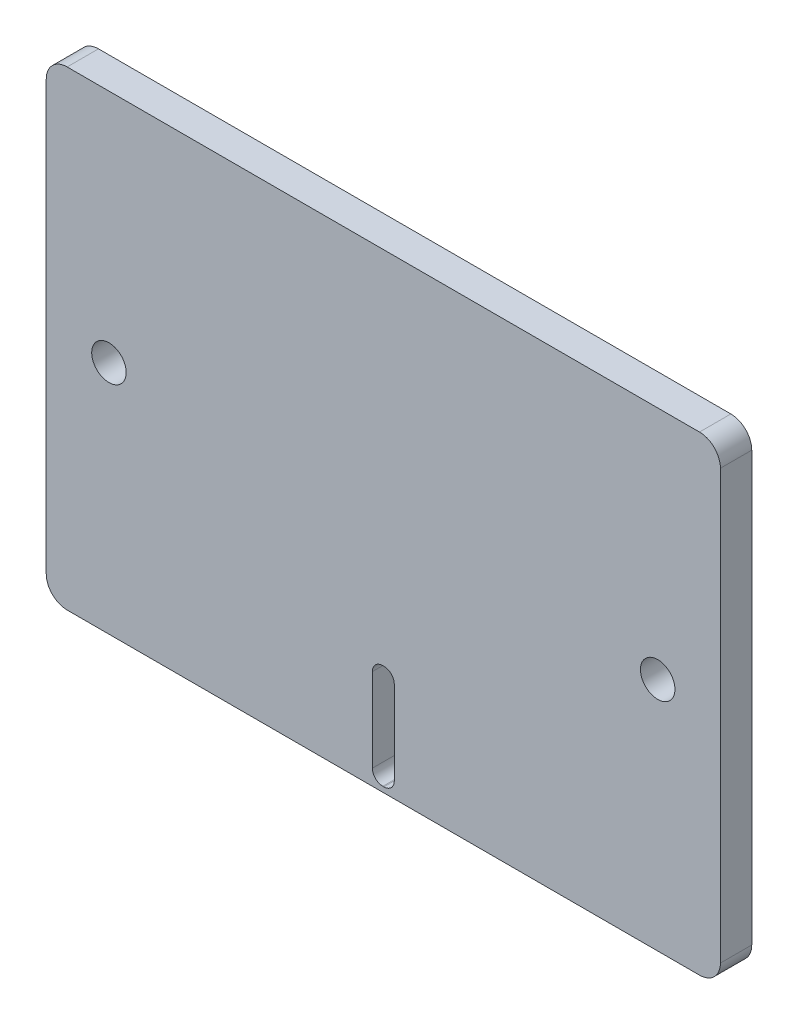
ISO-10303-21;
HEADER;
FILE_DESCRIPTION(('STEP AP214'),'2;1');
FILE_NAME('part.step','',(''),(''),'','','');
FILE_SCHEMA(('AUTOMOTIVE_DESIGN { 1 0 10303 214 1 1 1 1 }'));
ENDSEC;
DATA;
#1=APPLICATION_CONTEXT('core data for automotive mechanical design processes');
#2=APPLICATION_PROTOCOL_DEFINITION('international standard','automotive_design',2000,#1);
#3=PRODUCT_CONTEXT('',#1,'mechanical');
#4=PRODUCT('Part','Part','',(#3));
#5=PRODUCT_RELATED_PRODUCT_CATEGORY('part','',(#4));
#6=PRODUCT_DEFINITION_FORMATION('','',#4);
#7=PRODUCT_DEFINITION_CONTEXT('part definition',#1,'design');
#8=PRODUCT_DEFINITION('design','',#6,#7);
#9=PRODUCT_DEFINITION_SHAPE('','',#8);
#10=(LENGTH_UNIT() NAMED_UNIT(*) SI_UNIT(.MILLI.,.METRE.));
#11=(NAMED_UNIT(*) PLANE_ANGLE_UNIT() SI_UNIT($,.RADIAN.));
#12=(NAMED_UNIT(*) SI_UNIT($,.STERADIAN.) SOLID_ANGLE_UNIT());
#13=UNCERTAINTY_MEASURE_WITH_UNIT(LENGTH_MEASURE(1.E-05),#10,'distance_accuracy_value','');
#14=(GEOMETRIC_REPRESENTATION_CONTEXT(3) GLOBAL_UNCERTAINTY_ASSIGNED_CONTEXT((#13)) GLOBAL_UNIT_ASSIGNED_CONTEXT((#10,
#11,#12)) REPRESENTATION_CONTEXT('',''));
#15=CARTESIAN_POINT('',(0.,0.,0.));
#16=DIRECTION('',(0.,0.,1.));
#17=DIRECTION('',(1.,0.,0.));
#18=AXIS2_PLACEMENT_3D('',#15,#16,#17);
#19=CARTESIAN_POINT('',(32.25,-22.5,3.));
#20=DIRECTION('',(-1.,0.,0.));
#21=DIRECTION('',(0.,0.,1.));
#22=AXIS2_PLACEMENT_3D('',#19,#20,#21);
#23=PLANE('',#22);
#24=DIRECTION('',(0.,0.,-1.));
#25=VECTOR('',#24,1.);
#26=CARTESIAN_POINT('',(32.25,-20.5,3.));
#27=LINE('',#26,#25);
#28=CARTESIAN_POINT('',(32.25,-20.5,3.));
#29=VERTEX_POINT('',#28);
#30=CARTESIAN_POINT('',(32.25,-20.5,0.));
#31=VERTEX_POINT('',#30);
#32=EDGE_CURVE('E201',#29,#31,#27,.T.);
#33=ORIENTED_EDGE('',*,*,#32,.T.);
#34=DIRECTION('',(0.,1.,0.));
#35=VECTOR('',#34,1.);
#36=CARTESIAN_POINT('',(32.25,-22.5,0.));
#37=LINE('',#36,#35);
#38=CARTESIAN_POINT('',(32.25,20.5,0.));
#39=VERTEX_POINT('',#38);
#40=EDGE_CURVE('E179',#31,#39,#37,.T.);
#41=ORIENTED_EDGE('',*,*,#40,.T.);
#42=DIRECTION('',(0.,0.,-1.));
#43=VECTOR('',#42,1.);
#44=CARTESIAN_POINT('',(32.25,20.5,3.));
#45=LINE('',#44,#43);
#46=CARTESIAN_POINT('',(32.25,20.5,3.));
#47=VERTEX_POINT('',#46);
#48=EDGE_CURVE('E198',#39,#47,#45,.F.);
#49=ORIENTED_EDGE('',*,*,#48,.T.);
#50=DIRECTION('',(0.,1.,0.));
#51=VECTOR('',#50,1.);
#52=CARTESIAN_POINT('',(32.25,-22.5,3.));
#53=LINE('',#52,#51);
#54=EDGE_CURVE('E177',#29,#47,#53,.T.);
#55=ORIENTED_EDGE('',*,*,#54,.F.);
#56=EDGE_LOOP('',(#33,#41,#49,#55));
#57=FACE_BOUND('',#56,.T.);
#58=ADVANCED_FACE('F34',(#57),#23,.F.);
#59=CARTESIAN_POINT('',(-32.25,22.5,3.));
#60=DIRECTION('',(0.,-1.,0.));
#61=DIRECTION('',(0.,0.,-1.));
#62=AXIS2_PLACEMENT_3D('',#59,#60,#61);
#63=PLANE('',#62);
#64=DIRECTION('',(-1.,0.,0.));
#65=VECTOR('',#64,1.);
#66=CARTESIAN_POINT('',(-32.25,22.5,0.));
#67=LINE('',#66,#65);
#68=CARTESIAN_POINT('',(30.25,22.5,0.));
#69=VERTEX_POINT('',#68);
#70=CARTESIAN_POINT('',(-30.25,22.5,0.));
#71=VERTEX_POINT('',#70);
#72=EDGE_CURVE('E174',#69,#71,#67,.T.);
#73=ORIENTED_EDGE('',*,*,#72,.T.);
#74=DIRECTION('',(0.,0.,-1.));
#75=VECTOR('',#74,1.);
#76=CARTESIAN_POINT('',(-30.25,22.5,3.));
#77=LINE('',#76,#75);
#78=CARTESIAN_POINT('',(-30.25,22.5,3.));
#79=VERTEX_POINT('',#78);
#80=EDGE_CURVE('E152',#71,#79,#77,.F.);
#81=ORIENTED_EDGE('',*,*,#80,.T.);
#82=DIRECTION('',(-1.,0.,0.));
#83=VECTOR('',#82,1.);
#84=CARTESIAN_POINT('',(-32.25,22.5,3.));
#85=LINE('',#84,#83);
#86=CARTESIAN_POINT('',(30.25,22.5,3.));
#87=VERTEX_POINT('',#86);
#88=EDGE_CURVE('E311',#87,#79,#85,.T.);
#89=ORIENTED_EDGE('',*,*,#88,.F.);
#90=DIRECTION('',(0.,0.,-1.));
#91=VECTOR('',#90,1.);
#92=CARTESIAN_POINT('',(30.25,22.5,3.));
#93=LINE('',#92,#91);
#94=EDGE_CURVE('E157',#87,#69,#93,.T.);
#95=ORIENTED_EDGE('',*,*,#94,.T.);
#96=EDGE_LOOP('',(#73,#81,#89,#95));
#97=FACE_BOUND('',#96,.T.);
#98=ADVANCED_FACE('F329',(#97),#63,.F.);
#99=CARTESIAN_POINT('',(-32.25,-22.5,3.));
#100=DIRECTION('',(1.,0.,0.));
#101=DIRECTION('',(0.,0.,-1.));
#102=AXIS2_PLACEMENT_3D('',#99,#100,#101);
#103=PLANE('',#102);
#104=DIRECTION('',(0.,-1.,0.));
#105=VECTOR('',#104,1.);
#106=CARTESIAN_POINT('',(-32.25,-22.5,0.));
#107=LINE('',#106,#105);
#108=CARTESIAN_POINT('',(-32.25,20.5,0.));
#109=VERTEX_POINT('',#108);
#110=CARTESIAN_POINT('',(-32.25,-20.5,0.));
#111=VERTEX_POINT('',#110);
#112=EDGE_CURVE('E164',#109,#111,#107,.T.);
#113=ORIENTED_EDGE('',*,*,#112,.T.);
#114=DIRECTION('',(0.,0.,-1.));
#115=VECTOR('',#114,1.);
#116=CARTESIAN_POINT('',(-32.25,-20.5,3.));
#117=LINE('',#116,#115);
#118=CARTESIAN_POINT('',(-32.25,-20.5,3.));
#119=VERTEX_POINT('',#118);
#120=EDGE_CURVE('E209',#111,#119,#117,.F.);
#121=ORIENTED_EDGE('',*,*,#120,.T.);
#122=DIRECTION('',(0.,-1.,0.));
#123=VECTOR('',#122,1.);
#124=CARTESIAN_POINT('',(-32.25,-22.5,3.));
#125=LINE('',#124,#123);
#126=CARTESIAN_POINT('',(-32.25,20.5,3.));
#127=VERTEX_POINT('',#126);
#128=EDGE_CURVE('E166',#127,#119,#125,.T.);
#129=ORIENTED_EDGE('',*,*,#128,.F.);
#130=DIRECTION('',(0.,0.,-1.));
#131=VECTOR('',#130,1.);
#132=CARTESIAN_POINT('',(-32.25,20.5,3.));
#133=LINE('',#132,#131);
#134=EDGE_CURVE('E151',#127,#109,#133,.T.);
#135=ORIENTED_EDGE('',*,*,#134,.T.);
#136=EDGE_LOOP('',(#113,#121,#129,#135));
#137=FACE_BOUND('',#136,.T.);
#138=ADVANCED_FACE('F162',(#137),#103,.F.);
#139=CARTESIAN_POINT('',(-32.25,-22.5,3.));
#140=DIRECTION('',(0.,1.,0.));
#141=DIRECTION('',(0.,0.,1.));
#142=AXIS2_PLACEMENT_3D('',#139,#140,#141);
#143=PLANE('',#142);
#144=DIRECTION('',(1.,0.,0.));
#145=VECTOR('',#144,1.);
#146=CARTESIAN_POINT('',(-32.25,-22.5,0.));
#147=LINE('',#146,#145);
#148=CARTESIAN_POINT('',(-30.25,-22.5,0.));
#149=VERTEX_POINT('',#148);
#150=CARTESIAN_POINT('',(30.25,-22.5,0.));
#151=VERTEX_POINT('',#150);
#152=EDGE_CURVE('E173',#149,#151,#147,.T.);
#153=ORIENTED_EDGE('',*,*,#152,.T.);
#154=DIRECTION('',(0.,0.,-1.));
#155=VECTOR('',#154,1.);
#156=CARTESIAN_POINT('',(30.25,-22.5,3.));
#157=LINE('',#156,#155);
#158=CARTESIAN_POINT('',(30.25,-22.5,3.));
#159=VERTEX_POINT('',#158);
#160=EDGE_CURVE('E207',#151,#159,#157,.F.);
#161=ORIENTED_EDGE('',*,*,#160,.T.);
#162=DIRECTION('',(1.,0.,0.));
#163=VECTOR('',#162,1.);
#164=CARTESIAN_POINT('',(-32.25,-22.5,3.));
#165=LINE('',#164,#163);
#166=CARTESIAN_POINT('',(-30.25,-22.5,3.));
#167=VERTEX_POINT('',#166);
#168=EDGE_CURVE('E168',#167,#159,#165,.T.);
#169=ORIENTED_EDGE('',*,*,#168,.F.);
#170=DIRECTION('',(0.,0.,-1.));
#171=VECTOR('',#170,1.);
#172=CARTESIAN_POINT('',(-30.25,-22.5,3.));
#173=LINE('',#172,#171);
#174=EDGE_CURVE('E204',#167,#149,#173,.T.);
#175=ORIENTED_EDGE('',*,*,#174,.T.);
#176=EDGE_LOOP('',(#153,#161,#169,#175));
#177=FACE_BOUND('',#176,.T.);
#178=ADVANCED_FACE('F336',(#177),#143,.F.);
#179=CARTESIAN_POINT('',(0.,0.,3.));
#180=DIRECTION('',(0.,0.,-1.));
#181=DIRECTION('',(-1.,0.,0.));
#182=AXIS2_PLACEMENT_3D('',#179,#180,#181);
#183=PLANE('',#182);
#184=DIRECTION('',(-1.,0.,0.));
#185=VECTOR('',#184,1.);
#186=CARTESIAN_POINT('',(-1.05,-12.,3.));
#187=LINE('',#186,#185);
#188=CARTESIAN_POINT('',(0.0500000000000023,-12.,3.));
#189=VERTEX_POINT('',#188);
#190=CARTESIAN_POINT('',(-0.0499999999999982,-12.,3.));
#191=VERTEX_POINT('',#190);
#192=EDGE_CURVE('E264',#189,#191,#187,.T.);
#193=ORIENTED_EDGE('',*,*,#192,.F.);
#194=CARTESIAN_POINT('',(0.0500000000000023,-13.,3.));
#195=DIRECTION('',(0.,0.,-1.));
#196=DIRECTION('',(-1.,0.,0.));
#197=AXIS2_PLACEMENT_3D('',#194,#195,#196);
#198=CIRCLE('',#197,1.);
#199=CARTESIAN_POINT('',(1.05,-13.,3.));
#200=VERTEX_POINT('',#199);
#201=EDGE_CURVE('E42',#189,#200,#198,.T.);
#202=ORIENTED_EDGE('',*,*,#201,.T.);
#203=DIRECTION('',(0.,1.,0.));
#204=VECTOR('',#203,1.);
#205=CARTESIAN_POINT('',(1.05,-12.,3.));
#206=LINE('',#205,#204);
#207=CARTESIAN_POINT('',(1.05,-21.,3.));
#208=VERTEX_POINT('',#207);
#209=EDGE_CURVE('E263',#208,#200,#206,.T.);
#210=ORIENTED_EDGE('',*,*,#209,.F.);
#211=CARTESIAN_POINT('',(0.0500000000000033,-21.,3.));
#212=DIRECTION('',(0.,0.,-1.));
#213=DIRECTION('',(-1.,0.,0.));
#214=AXIS2_PLACEMENT_3D('',#211,#212,#213);
#215=CIRCLE('',#214,1.);
#216=CARTESIAN_POINT('',(0.0500000000000032,-22.,3.));
#217=VERTEX_POINT('',#216);
#218=EDGE_CURVE('E249',#208,#217,#215,.T.);
#219=ORIENTED_EDGE('',*,*,#218,.T.);
#220=DIRECTION('',(1.,0.,0.));
#221=VECTOR('',#220,1.);
#222=CARTESIAN_POINT('',(-1.05,-22.,3.));
#223=LINE('',#222,#221);
#224=CARTESIAN_POINT('',(-0.0499999999999973,-22.,3.));
#225=VERTEX_POINT('',#224);
#226=EDGE_CURVE('E298',#225,#217,#223,.T.);
#227=ORIENTED_EDGE('',*,*,#226,.F.);
#228=CARTESIAN_POINT('',(-0.0499999999999973,-21.,3.));
#229=DIRECTION('',(0.,0.,-1.));
#230=DIRECTION('',(-1.,0.,0.));
#231=AXIS2_PLACEMENT_3D('',#228,#229,#230);
#232=CIRCLE('',#231,1.);
#233=CARTESIAN_POINT('',(-1.05,-21.,3.));
#234=VERTEX_POINT('',#233);
#235=EDGE_CURVE('E253',#225,#234,#232,.T.);
#236=ORIENTED_EDGE('',*,*,#235,.T.);
#237=DIRECTION('',(0.,-1.,0.));
#238=VECTOR('',#237,1.);
#239=CARTESIAN_POINT('',(-1.05,-12.,3.));
#240=LINE('',#239,#238);
#241=CARTESIAN_POINT('',(-1.05,-13.,3.));
#242=VERTEX_POINT('',#241);
#243=EDGE_CURVE('E287',#242,#234,#240,.T.);
#244=ORIENTED_EDGE('',*,*,#243,.F.);
#245=CARTESIAN_POINT('',(-0.0499999999999983,-13.,3.));
#246=DIRECTION('',(0.,0.,-1.));
#247=DIRECTION('',(-1.,0.,0.));
#248=AXIS2_PLACEMENT_3D('',#245,#246,#247);
#249=CIRCLE('',#248,1.);
#250=EDGE_CURVE('E49',#242,#191,#249,.T.);
#251=ORIENTED_EDGE('',*,*,#250,.T.);
#252=EDGE_LOOP('',(#193,#202,#210,#219,#227,#236,#244,#251));
#253=FACE_BOUND('',#252,.T.);
#254=CARTESIAN_POINT('',(-26.25,0.,3.));
#255=DIRECTION('',(0.,0.,1.));
#256=DIRECTION('',(1.,0.,0.));
#257=AXIS2_PLACEMENT_3D('',#254,#255,#256);
#258=CIRCLE('',#257,1.65);
#259=CARTESIAN_POINT('',(-24.6,0.,3.));
#260=VERTEX_POINT('',#259);
#261=EDGE_CURVE('E216',#260,#260,#258,.T.);
#262=ORIENTED_EDGE('',*,*,#261,.F.);
#263=EDGE_LOOP('',(#262));
#264=FACE_BOUND('',#263,.T.);
#265=CARTESIAN_POINT('',(26.25,0.,3.));
#266=DIRECTION('',(0.,0.,1.));
#267=DIRECTION('',(-1.,0.,0.));
#268=AXIS2_PLACEMENT_3D('',#265,#266,#267);
#269=CIRCLE('',#268,1.65);
#270=CARTESIAN_POINT('',(24.6,0.,3.));
#271=VERTEX_POINT('',#270);
#272=EDGE_CURVE('E301',#271,#271,#269,.T.);
#273=ORIENTED_EDGE('',*,*,#272,.F.);
#274=EDGE_LOOP('',(#273));
#275=FACE_BOUND('',#274,.T.);
#276=ORIENTED_EDGE('',*,*,#128,.T.);
#277=CARTESIAN_POINT('',(-30.25,-20.5,3.));
#278=DIRECTION('',(0.,0.,-1.));
#279=DIRECTION('',(-1.,0.,0.));
#280=AXIS2_PLACEMENT_3D('',#277,#278,#279);
#281=CIRCLE('',#280,2.);
#282=EDGE_CURVE('E190',#119,#167,#281,.F.);
#283=ORIENTED_EDGE('',*,*,#282,.T.);
#284=ORIENTED_EDGE('',*,*,#168,.T.);
#285=CARTESIAN_POINT('',(30.25,-20.5,3.));
#286=DIRECTION('',(0.,0.,-1.));
#287=DIRECTION('',(-1.,0.,0.));
#288=AXIS2_PLACEMENT_3D('',#285,#286,#287);
#289=CIRCLE('',#288,2.);
#290=EDGE_CURVE('E192',#159,#29,#289,.F.);
#291=ORIENTED_EDGE('',*,*,#290,.T.);
#292=ORIENTED_EDGE('',*,*,#54,.T.);
#293=CARTESIAN_POINT('',(30.25,20.5,3.));
#294=DIRECTION('',(0.,0.,-1.));
#295=DIRECTION('',(-1.,0.,0.));
#296=AXIS2_PLACEMENT_3D('',#293,#294,#295);
#297=CIRCLE('',#296,2.);
#298=EDGE_CURVE('E194',#47,#87,#297,.F.);
#299=ORIENTED_EDGE('',*,*,#298,.T.);
#300=ORIENTED_EDGE('',*,*,#88,.T.);
#301=CARTESIAN_POINT('',(-30.25,20.5,3.));
#302=DIRECTION('',(0.,0.,-1.));
#303=DIRECTION('',(-1.,0.,0.));
#304=AXIS2_PLACEMENT_3D('',#301,#302,#303);
#305=CIRCLE('',#304,2.);
#306=EDGE_CURVE('E196',#79,#127,#305,.F.);
#307=ORIENTED_EDGE('',*,*,#306,.T.);
#308=EDGE_LOOP('',(#276,#283,#284,#291,#292,#299,#300,#307));
#309=FACE_BOUND('',#308,.T.);
#310=ADVANCED_FACE('F261',(#253,#264,#275,#309),#183,.F.);
#311=CARTESIAN_POINT('',(0.,0.,0.));
#312=DIRECTION('',(0.,0.,-1.));
#313=DIRECTION('',(-1.,0.,0.));
#314=AXIS2_PLACEMENT_3D('',#311,#312,#313);
#315=PLANE('',#314);
#316=DIRECTION('',(0.,-1.,0.));
#317=VECTOR('',#316,1.);
#318=CARTESIAN_POINT('',(1.05,0.,0.));
#319=LINE('',#318,#317);
#320=CARTESIAN_POINT('',(1.05,-13.,0.));
#321=VERTEX_POINT('',#320);
#322=CARTESIAN_POINT('',(1.05,-21.,0.));
#323=VERTEX_POINT('',#322);
#324=EDGE_CURVE('E227',#321,#323,#319,.T.);
#325=ORIENTED_EDGE('',*,*,#324,.F.);
#326=CARTESIAN_POINT('',(0.0500000000000023,-13.,0.));
#327=DIRECTION('',(0.,0.,-1.));
#328=DIRECTION('',(-1.,0.,0.));
#329=AXIS2_PLACEMENT_3D('',#326,#327,#328);
#330=CIRCLE('',#329,1.);
#331=CARTESIAN_POINT('',(0.0500000000000023,-12.,0.));
#332=VERTEX_POINT('',#331);
#333=EDGE_CURVE('E11',#321,#332,#330,.F.);
#334=ORIENTED_EDGE('',*,*,#333,.T.);
#335=DIRECTION('',(1.,0.,0.));
#336=VECTOR('',#335,1.);
#337=CARTESIAN_POINT('',(0.,-12.,0.));
#338=LINE('',#337,#336);
#339=CARTESIAN_POINT('',(-0.0499999999999983,-12.,0.));
#340=VERTEX_POINT('',#339);
#341=EDGE_CURVE('E211',#340,#332,#338,.T.);
#342=ORIENTED_EDGE('',*,*,#341,.F.);
#343=CARTESIAN_POINT('',(-0.0499999999999983,-13.,0.));
#344=DIRECTION('',(0.,0.,-1.));
#345=DIRECTION('',(-1.,0.,0.));
#346=AXIS2_PLACEMENT_3D('',#343,#344,#345);
#347=CIRCLE('',#346,1.);
#348=CARTESIAN_POINT('',(-1.05,-13.,0.));
#349=VERTEX_POINT('',#348);
#350=EDGE_CURVE('E258',#340,#349,#347,.F.);
#351=ORIENTED_EDGE('',*,*,#350,.T.);
#352=DIRECTION('',(0.,1.,0.));
#353=VECTOR('',#352,1.);
#354=CARTESIAN_POINT('',(-1.05,0.,0.));
#355=LINE('',#354,#353);
#356=CARTESIAN_POINT('',(-1.05,-21.,0.));
#357=VERTEX_POINT('',#356);
#358=EDGE_CURVE('E221',#357,#349,#355,.T.);
#359=ORIENTED_EDGE('',*,*,#358,.F.);
#360=CARTESIAN_POINT('',(-0.0499999999999973,-21.,0.));
#361=DIRECTION('',(0.,0.,-1.));
#362=DIRECTION('',(-1.,0.,0.));
#363=AXIS2_PLACEMENT_3D('',#360,#361,#362);
#364=CIRCLE('',#363,1.);
#365=CARTESIAN_POINT('',(-0.0499999999999973,-22.,0.));
#366=VERTEX_POINT('',#365);
#367=EDGE_CURVE('E255',#357,#366,#364,.F.);
#368=ORIENTED_EDGE('',*,*,#367,.T.);
#369=DIRECTION('',(-1.,0.,0.));
#370=VECTOR('',#369,1.);
#371=CARTESIAN_POINT('',(0.,-22.,0.));
#372=LINE('',#371,#370);
#373=CARTESIAN_POINT('',(0.0500000000000033,-22.,0.));
#374=VERTEX_POINT('',#373);
#375=EDGE_CURVE('E224',#374,#366,#372,.T.);
#376=ORIENTED_EDGE('',*,*,#375,.F.);
#377=CARTESIAN_POINT('',(0.0500000000000033,-21.,0.));
#378=DIRECTION('',(0.,0.,-1.));
#379=DIRECTION('',(-1.,0.,0.));
#380=AXIS2_PLACEMENT_3D('',#377,#378,#379);
#381=CIRCLE('',#380,1.);
#382=EDGE_CURVE('E251',#374,#323,#381,.F.);
#383=ORIENTED_EDGE('',*,*,#382,.T.);
#384=EDGE_LOOP('',(#325,#334,#342,#351,#359,#368,#376,#383));
#385=FACE_BOUND('',#384,.T.);
#386=CARTESIAN_POINT('',(-26.25,0.,0.));
#387=DIRECTION('',(0.,0.,-1.));
#388=DIRECTION('',(-1.,0.,0.));
#389=AXIS2_PLACEMENT_3D('',#386,#387,#388);
#390=CIRCLE('',#389,1.65);
#391=CARTESIAN_POINT('',(-27.9,0.,0.));
#392=VERTEX_POINT('',#391);
#393=EDGE_CURVE('E215',#392,#392,#390,.T.);
#394=ORIENTED_EDGE('',*,*,#393,.F.);
#395=EDGE_LOOP('',(#394));
#396=FACE_BOUND('',#395,.T.);
#397=CARTESIAN_POINT('',(26.25,0.,0.));
#398=DIRECTION('',(0.,0.,-1.));
#399=DIRECTION('',(-1.,0.,0.));
#400=AXIS2_PLACEMENT_3D('',#397,#398,#399);
#401=CIRCLE('',#400,1.65);
#402=CARTESIAN_POINT('',(24.6,0.,0.));
#403=VERTEX_POINT('',#402);
#404=EDGE_CURVE('E212',#403,#403,#401,.T.);
#405=ORIENTED_EDGE('',*,*,#404,.F.);
#406=EDGE_LOOP('',(#405));
#407=FACE_BOUND('',#406,.T.);
#408=CARTESIAN_POINT('',(-30.25,-20.5,0.));
#409=DIRECTION('',(0.,0.,-1.));
#410=DIRECTION('',(-1.,0.,0.));
#411=AXIS2_PLACEMENT_3D('',#408,#409,#410);
#412=CIRCLE('',#411,2.);
#413=EDGE_CURVE('E167',#149,#111,#412,.T.);
#414=ORIENTED_EDGE('',*,*,#413,.T.);
#415=ORIENTED_EDGE('',*,*,#112,.F.);
#416=CARTESIAN_POINT('',(-30.25,20.5,0.));
#417=DIRECTION('',(0.,0.,-1.));
#418=DIRECTION('',(-1.,0.,0.));
#419=AXIS2_PLACEMENT_3D('',#416,#417,#418);
#420=CIRCLE('',#419,2.);
#421=EDGE_CURVE('E147',#109,#71,#420,.T.);
#422=ORIENTED_EDGE('',*,*,#421,.T.);
#423=ORIENTED_EDGE('',*,*,#72,.F.);
#424=CARTESIAN_POINT('',(30.25,20.5,0.));
#425=DIRECTION('',(0.,0.,-1.));
#426=DIRECTION('',(-1.,0.,0.));
#427=AXIS2_PLACEMENT_3D('',#424,#425,#426);
#428=CIRCLE('',#427,2.);
#429=EDGE_CURVE('E158',#69,#39,#428,.T.);
#430=ORIENTED_EDGE('',*,*,#429,.T.);
#431=ORIENTED_EDGE('',*,*,#40,.F.);
#432=CARTESIAN_POINT('',(30.25,-20.5,0.));
#433=DIRECTION('',(0.,0.,-1.));
#434=DIRECTION('',(-1.,0.,0.));
#435=AXIS2_PLACEMENT_3D('',#432,#433,#434);
#436=CIRCLE('',#435,2.);
#437=EDGE_CURVE('E184',#31,#151,#436,.T.);
#438=ORIENTED_EDGE('',*,*,#437,.T.);
#439=ORIENTED_EDGE('',*,*,#152,.F.);
#440=EDGE_LOOP('',(#414,#415,#422,#423,#430,#431,#438,#439));
#441=FACE_BOUND('',#440,.T.);
#442=ADVANCED_FACE('F170',(#385,#396,#407,#441),#315,.T.);
#443=CARTESIAN_POINT('',(-30.25,20.5,3.));
#444=DIRECTION('',(0.,0.,-1.));
#445=DIRECTION('',(-1.,0.,0.));
#446=AXIS2_PLACEMENT_3D('',#443,#444,#445);
#447=CYLINDRICAL_SURFACE('',#446,2.);
#448=ORIENTED_EDGE('',*,*,#306,.F.);
#449=ORIENTED_EDGE('',*,*,#80,.F.);
#450=ORIENTED_EDGE('',*,*,#421,.F.);
#451=ORIENTED_EDGE('',*,*,#134,.F.);
#452=EDGE_LOOP('',(#448,#449,#450,#451));
#453=FACE_BOUND('',#452,.T.);
#454=ADVANCED_FACE('F150',(#453),#447,.T.);
#455=CARTESIAN_POINT('',(30.25,20.5,3.));
#456=DIRECTION('',(0.,0.,-1.));
#457=DIRECTION('',(-1.,0.,0.));
#458=AXIS2_PLACEMENT_3D('',#455,#456,#457);
#459=CYLINDRICAL_SURFACE('',#458,2.);
#460=ORIENTED_EDGE('',*,*,#298,.F.);
#461=ORIENTED_EDGE('',*,*,#48,.F.);
#462=ORIENTED_EDGE('',*,*,#429,.F.);
#463=ORIENTED_EDGE('',*,*,#94,.F.);
#464=EDGE_LOOP('',(#460,#461,#462,#463));
#465=FACE_BOUND('',#464,.T.);
#466=ADVANCED_FACE('F324',(#465),#459,.T.);
#467=CARTESIAN_POINT('',(30.25,-20.5,3.));
#468=DIRECTION('',(0.,0.,-1.));
#469=DIRECTION('',(-1.,0.,0.));
#470=AXIS2_PLACEMENT_3D('',#467,#468,#469);
#471=CYLINDRICAL_SURFACE('',#470,2.);
#472=ORIENTED_EDGE('',*,*,#290,.F.);
#473=ORIENTED_EDGE('',*,*,#160,.F.);
#474=ORIENTED_EDGE('',*,*,#437,.F.);
#475=ORIENTED_EDGE('',*,*,#32,.F.);
#476=EDGE_LOOP('',(#472,#473,#474,#475));
#477=FACE_BOUND('',#476,.T.);
#478=ADVANCED_FACE('F345',(#477),#471,.T.);
#479=CARTESIAN_POINT('',(-30.25,-20.5,3.));
#480=DIRECTION('',(0.,0.,-1.));
#481=DIRECTION('',(-1.,0.,0.));
#482=AXIS2_PLACEMENT_3D('',#479,#480,#481);
#483=CYLINDRICAL_SURFACE('',#482,2.);
#484=ORIENTED_EDGE('',*,*,#282,.F.);
#485=ORIENTED_EDGE('',*,*,#120,.F.);
#486=ORIENTED_EDGE('',*,*,#413,.F.);
#487=ORIENTED_EDGE('',*,*,#174,.F.);
#488=EDGE_LOOP('',(#484,#485,#486,#487));
#489=FACE_BOUND('',#488,.T.);
#490=ADVANCED_FACE('F348',(#489),#483,.T.);
#491=CARTESIAN_POINT('',(26.25,0.,-7.));
#492=DIRECTION('',(0.,0.,1.));
#493=DIRECTION('',(1.,0.,0.));
#494=AXIS2_PLACEMENT_3D('',#491,#492,#493);
#495=CYLINDRICAL_SURFACE('',#494,1.65);
#496=ORIENTED_EDGE('',*,*,#404,.T.);
#497=EDGE_LOOP('',(#496));
#498=FACE_BOUND('',#497,.T.);
#499=ORIENTED_EDGE('',*,*,#272,.T.);
#500=EDGE_LOOP('',(#499));
#501=FACE_BOUND('',#500,.T.);
#502=ADVANCED_FACE('F352',(#498,#501),#495,.F.);
#503=CARTESIAN_POINT('',(-26.25,0.,-7.));
#504=DIRECTION('',(0.,0.,1.));
#505=DIRECTION('',(1.,0.,0.));
#506=AXIS2_PLACEMENT_3D('',#503,#504,#505);
#507=CYLINDRICAL_SURFACE('',#506,1.65);
#508=ORIENTED_EDGE('',*,*,#393,.T.);
#509=EDGE_LOOP('',(#508));
#510=FACE_BOUND('',#509,.T.);
#511=ORIENTED_EDGE('',*,*,#261,.T.);
#512=EDGE_LOOP('',(#511));
#513=FACE_BOUND('',#512,.T.);
#514=ADVANCED_FACE('F412',(#510,#513),#507,.F.);
#515=CARTESIAN_POINT('',(1.05,-12.,-7.));
#516=DIRECTION('',(1.,0.,0.));
#517=DIRECTION('',(0.,1.,0.));
#518=AXIS2_PLACEMENT_3D('',#515,#516,#517);
#519=PLANE('',#518);
#520=ORIENTED_EDGE('',*,*,#324,.T.);
#521=DIRECTION('',(0.,0.,1.));
#522=VECTOR('',#521,1.);
#523=CARTESIAN_POINT('',(1.05,-21.,3.));
#524=LINE('',#523,#522);
#525=EDGE_CURVE('E232',#323,#208,#524,.T.);
#526=ORIENTED_EDGE('',*,*,#525,.T.);
#527=ORIENTED_EDGE('',*,*,#209,.T.);
#528=DIRECTION('',(0.,0.,1.));
#529=VECTOR('',#528,1.);
#530=CARTESIAN_POINT('',(1.05,-13.,0.));
#531=LINE('',#530,#529);
#532=EDGE_CURVE('E230',#200,#321,#531,.F.);
#533=ORIENTED_EDGE('',*,*,#532,.T.);
#534=EDGE_LOOP('',(#520,#526,#527,#533));
#535=FACE_BOUND('',#534,.T.);
#536=ADVANCED_FACE('F266',(#535),#519,.F.);
#537=CARTESIAN_POINT('',(-1.05,-22.,-7.));
#538=DIRECTION('',(0.,-1.,0.));
#539=DIRECTION('',(0.,0.,-1.));
#540=AXIS2_PLACEMENT_3D('',#537,#538,#539);
#541=PLANE('',#540);
#542=ORIENTED_EDGE('',*,*,#226,.T.);
#543=DIRECTION('',(0.,0.,1.));
#544=VECTOR('',#543,1.);
#545=CARTESIAN_POINT('',(0.0500000000000033,-22.,0.));
#546=LINE('',#545,#544);
#547=EDGE_CURVE('E238',#217,#374,#546,.F.);
#548=ORIENTED_EDGE('',*,*,#547,.T.);
#549=ORIENTED_EDGE('',*,*,#375,.T.);
#550=DIRECTION('',(0.,0.,1.));
#551=VECTOR('',#550,1.);
#552=CARTESIAN_POINT('',(-0.0499999999999973,-22.,3.));
#553=LINE('',#552,#551);
#554=EDGE_CURVE('E235',#366,#225,#553,.T.);
#555=ORIENTED_EDGE('',*,*,#554,.T.);
#556=EDGE_LOOP('',(#542,#548,#549,#555));
#557=FACE_BOUND('',#556,.T.);
#558=ADVANCED_FACE('F295',(#557),#541,.F.);
#559=CARTESIAN_POINT('',(-1.05,-12.,-7.));
#560=DIRECTION('',(-1.,0.,0.));
#561=DIRECTION('',(0.,-1.,0.));
#562=AXIS2_PLACEMENT_3D('',#559,#560,#561);
#563=PLANE('',#562);
#564=ORIENTED_EDGE('',*,*,#243,.T.);
#565=DIRECTION('',(0.,0.,1.));
#566=VECTOR('',#565,1.);
#567=CARTESIAN_POINT('',(-1.05,-21.,0.));
#568=LINE('',#567,#566);
#569=EDGE_CURVE('E243',#234,#357,#568,.F.);
#570=ORIENTED_EDGE('',*,*,#569,.T.);
#571=ORIENTED_EDGE('',*,*,#358,.T.);
#572=DIRECTION('',(0.,0.,1.));
#573=VECTOR('',#572,1.);
#574=CARTESIAN_POINT('',(-1.05,-13.,3.));
#575=LINE('',#574,#573);
#576=EDGE_CURVE('E240',#349,#242,#575,.T.);
#577=ORIENTED_EDGE('',*,*,#576,.T.);
#578=EDGE_LOOP('',(#564,#570,#571,#577));
#579=FACE_BOUND('',#578,.T.);
#580=ADVANCED_FACE('F285',(#579),#563,.F.);
#581=CARTESIAN_POINT('',(-1.05,-12.,-7.));
#582=DIRECTION('',(0.,1.,0.));
#583=DIRECTION('',(0.,0.,1.));
#584=AXIS2_PLACEMENT_3D('',#581,#582,#583);
#585=PLANE('',#584);
#586=ORIENTED_EDGE('',*,*,#192,.T.);
#587=DIRECTION('',(0.,0.,1.));
#588=VECTOR('',#587,1.);
#589=CARTESIAN_POINT('',(-0.0499999999999983,-12.,0.));
#590=LINE('',#589,#588);
#591=EDGE_CURVE('E247',#191,#340,#590,.F.);
#592=ORIENTED_EDGE('',*,*,#591,.T.);
#593=ORIENTED_EDGE('',*,*,#341,.T.);
#594=DIRECTION('',(0.,0.,1.));
#595=VECTOR('',#594,1.);
#596=CARTESIAN_POINT('',(0.0500000000000023,-12.,3.));
#597=LINE('',#596,#595);
#598=EDGE_CURVE('E245',#332,#189,#597,.T.);
#599=ORIENTED_EDGE('',*,*,#598,.T.);
#600=EDGE_LOOP('',(#586,#592,#593,#599));
#601=FACE_BOUND('',#600,.T.);
#602=ADVANCED_FACE('F276',(#601),#585,.F.);
#603=CARTESIAN_POINT('',(0.0500000000000033,-21.,-7.));
#604=DIRECTION('',(0.,0.,-1.));
#605=DIRECTION('',(-1.,0.,0.));
#606=AXIS2_PLACEMENT_3D('',#603,#604,#605);
#607=CYLINDRICAL_SURFACE('',#606,1.);
#608=ORIENTED_EDGE('',*,*,#382,.F.);
#609=ORIENTED_EDGE('',*,*,#547,.F.);
#610=ORIENTED_EDGE('',*,*,#218,.F.);
#611=ORIENTED_EDGE('',*,*,#525,.F.);
#612=EDGE_LOOP('',(#608,#609,#610,#611));
#613=FACE_BOUND('',#612,.T.);
#614=ADVANCED_FACE('F300',(#613),#607,.F.);
#615=CARTESIAN_POINT('',(-0.0499999999999973,-21.,-7.));
#616=DIRECTION('',(0.,0.,-1.));
#617=DIRECTION('',(-1.,0.,0.));
#618=AXIS2_PLACEMENT_3D('',#615,#616,#617);
#619=CYLINDRICAL_SURFACE('',#618,1.);
#620=ORIENTED_EDGE('',*,*,#367,.F.);
#621=ORIENTED_EDGE('',*,*,#569,.F.);
#622=ORIENTED_EDGE('',*,*,#235,.F.);
#623=ORIENTED_EDGE('',*,*,#554,.F.);
#624=EDGE_LOOP('',(#620,#621,#622,#623));
#625=FACE_BOUND('',#624,.T.);
#626=ADVANCED_FACE('F289',(#625),#619,.F.);
#627=CARTESIAN_POINT('',(-0.0499999999999983,-13.,-7.));
#628=DIRECTION('',(0.,0.,-1.));
#629=DIRECTION('',(-1.,0.,0.));
#630=AXIS2_PLACEMENT_3D('',#627,#628,#629);
#631=CYLINDRICAL_SURFACE('',#630,1.);
#632=ORIENTED_EDGE('',*,*,#350,.F.);
#633=ORIENTED_EDGE('',*,*,#591,.F.);
#634=ORIENTED_EDGE('',*,*,#250,.F.);
#635=ORIENTED_EDGE('',*,*,#576,.F.);
#636=EDGE_LOOP('',(#632,#633,#634,#635));
#637=FACE_BOUND('',#636,.T.);
#638=ADVANCED_FACE('F279',(#637),#631,.F.);
#639=CARTESIAN_POINT('',(0.0500000000000023,-13.,-7.));
#640=DIRECTION('',(0.,0.,-1.));
#641=DIRECTION('',(-1.,0.,0.));
#642=AXIS2_PLACEMENT_3D('',#639,#640,#641);
#643=CYLINDRICAL_SURFACE('',#642,1.);
#644=ORIENTED_EDGE('',*,*,#333,.F.);
#645=ORIENTED_EDGE('',*,*,#532,.F.);
#646=ORIENTED_EDGE('',*,*,#201,.F.);
#647=ORIENTED_EDGE('',*,*,#598,.F.);
#648=EDGE_LOOP('',(#644,#645,#646,#647));
#649=FACE_BOUND('',#648,.T.);
#650=ADVANCED_FACE('F36',(#649),#643,.F.);
#651=CLOSED_SHELL('',(#58,#98,#138,#178,#310,#442,#454,#466,#478,#490,#502,#514,#536,#558,#580,
#602,#614,#626,#638,#650));
#652=MANIFOLD_SOLID_BREP('B2',#651);
#653=ADVANCED_BREP_SHAPE_REPRESENTATION('',(#18,#652),#14);
#654=SHAPE_DEFINITION_REPRESENTATION(#9,#653);
ENDSEC;
END-ISO-10303-21;
